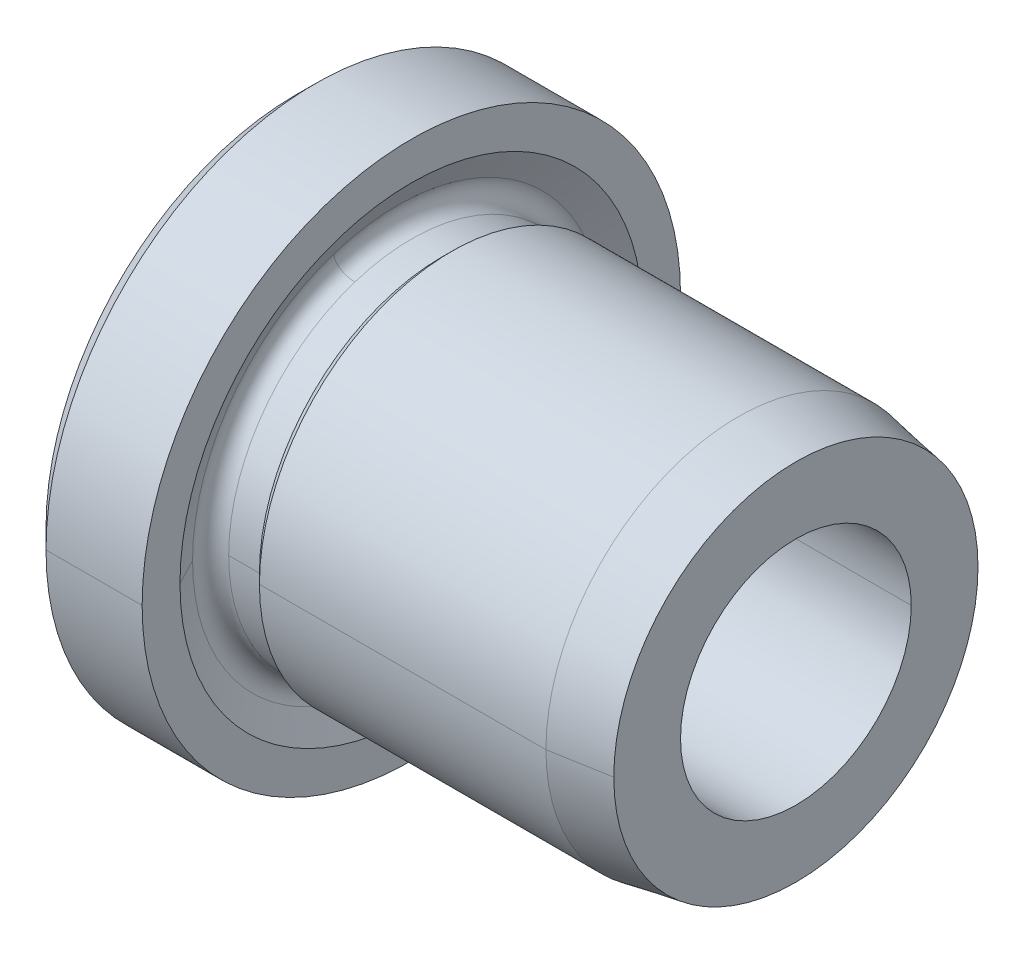
ISO-10303-21;
HEADER;
FILE_DESCRIPTION(('STEP AP214'),'2;1');
FILE_NAME('part.step','',(''),(''),'','','');
FILE_SCHEMA(('AUTOMOTIVE_DESIGN { 1 0 10303 214 1 1 1 1 }'));
ENDSEC;
DATA;
#1=APPLICATION_CONTEXT('core data for automotive mechanical design processes');
#2=APPLICATION_PROTOCOL_DEFINITION('international standard','automotive_design',2000,#1);
#3=PRODUCT_CONTEXT('',#1,'mechanical');
#4=PRODUCT('Part','Part','',(#3));
#5=PRODUCT_RELATED_PRODUCT_CATEGORY('part','',(#4));
#6=PRODUCT_DEFINITION_FORMATION('','',#4);
#7=PRODUCT_DEFINITION_CONTEXT('part definition',#1,'design');
#8=PRODUCT_DEFINITION('design','',#6,#7);
#9=PRODUCT_DEFINITION_SHAPE('','',#8);
#10=(LENGTH_UNIT() NAMED_UNIT(*) SI_UNIT(.MILLI.,.METRE.));
#11=(NAMED_UNIT(*) PLANE_ANGLE_UNIT() SI_UNIT($,.RADIAN.));
#12=(NAMED_UNIT(*) SI_UNIT($,.STERADIAN.) SOLID_ANGLE_UNIT());
#13=UNCERTAINTY_MEASURE_WITH_UNIT(LENGTH_MEASURE(1.E-05),#10,'distance_accuracy_value','');
#14=(GEOMETRIC_REPRESENTATION_CONTEXT(3) GLOBAL_UNCERTAINTY_ASSIGNED_CONTEXT((#13)) GLOBAL_UNIT_ASSIGNED_CONTEXT((#10,
#11,#12)) REPRESENTATION_CONTEXT('',''));
#15=CARTESIAN_POINT('',(0.,0.,0.));
#16=DIRECTION('',(0.,0.,1.));
#17=DIRECTION('',(1.,0.,0.));
#18=AXIS2_PLACEMENT_3D('',#15,#16,#17);
#19=CARTESIAN_POINT('',(0.,0.,0.));
#20=DIRECTION('',(1.,0.,0.));
#21=DIRECTION('',(0.,0.,-1.));
#22=AXIS2_PLACEMENT_3D('',#19,#20,#21);
#23=PLANE('',#22);
#24=CARTESIAN_POINT('',(0.,0.,0.));
#25=DIRECTION('',(1.,0.,0.));
#26=DIRECTION('',(0.,0.,-1.));
#27=AXIS2_PLACEMENT_3D('',#24,#25,#26);
#28=CIRCLE('',#27,6.5);
#29=CARTESIAN_POINT('',(0.,0.,6.5));
#30=VERTEX_POINT('',#29);
#31=CARTESIAN_POINT('',(0.,0.,-6.5));
#32=VERTEX_POINT('',#31);
#33=EDGE_CURVE('E11',#30,#32,#28,.T.);
#34=ORIENTED_EDGE('',*,*,#33,.F.);
#35=CARTESIAN_POINT('',(0.,0.,0.));
#36=DIRECTION('',(1.,0.,0.));
#37=DIRECTION('',(0.,0.,-1.));
#38=AXIS2_PLACEMENT_3D('',#35,#36,#37);
#39=CIRCLE('',#38,6.5);
#40=EDGE_CURVE('E25',#32,#30,#39,.T.);
#41=ORIENTED_EDGE('',*,*,#40,.F.);
#42=EDGE_LOOP('',(#34,#41));
#43=FACE_BOUND('',#42,.T.);
#44=CARTESIAN_POINT('',(0.,0.,0.));
#45=DIRECTION('',(1.,0.,0.));
#46=DIRECTION('',(0.,0.,-1.));
#47=AXIS2_PLACEMENT_3D('',#44,#45,#46);
#48=CIRCLE('',#47,4.);
#49=CARTESIAN_POINT('',(0.,3.80422606518069,1.23606797749981));
#50=VERTEX_POINT('',#49);
#51=CARTESIAN_POINT('',(0.,-3.80422606518069,-1.23606797749981));
#52=VERTEX_POINT('',#51);
#53=EDGE_CURVE('E433',#50,#52,#48,.T.);
#54=ORIENTED_EDGE('',*,*,#53,.T.);
#55=CARTESIAN_POINT('',(0.,-3.80422606518061,-1.23606797749979));
#56=CARTESIAN_POINT('',(0.,-3.41553987761303,-2.43066938766863));
#57=CARTESIAN_POINT('',(0.,-2.55983013383947,-3.47605013012446));
#58=CARTESIAN_POINT('',(0.,-1.30682479287781,-4.1128624749789));
#59=CARTESIAN_POINT('',(0.,1.38818666463429,-4.27239924427118));
#60=CARTESIAN_POINT('',(0.,3.47472337360838,-2.55924329720119));
#61=CARTESIAN_POINT('',(0.,4.11411708370573,-1.30755322752522));
#62=CARTESIAN_POINT('',(0.,4.19194142522466,0.0411511263469084));
#63=CARTESIAN_POINT('',(0.,3.80422606518061,1.23606797749979));
#64=B_SPLINE_CURVE_WITH_KNOTS('',5,(#55,#56,#57,#58,#59,#60,#61,#62,#63),.UNSPECIFIED.,.F.,.F.,
(6,3,6),(0.,1.5707963267949,3.14159265358979),.UNSPECIFIED.);
#65=EDGE_CURVE('E435',#52,#50,#64,.T.);
#66=ORIENTED_EDGE('',*,*,#65,.T.);
#67=EDGE_LOOP('',(#54,#66));
#68=FACE_BOUND('',#67,.T.);
#69=ADVANCED_FACE('F16',(#43,#68),#23,.F.);
#70=CARTESIAN_POINT('',(1.00000000000008,0.,0.));
#71=DIRECTION('',(1.,0.,0.));
#72=DIRECTION('',(0.,-0.309016994374947,0.951056516295154));
#73=AXIS2_PLACEMENT_3D('',#70,#71,#72);
#74=TOROIDAL_SURFACE('',#73,4.00000000000008,1.00000000000008);
#75=CARTESIAN_POINT('',(1.00000000000008,-3.80422606518069,-1.23606797749981));
#76=DIRECTION('',(0.,0.309016994374947,-0.951056516295154));
#77=DIRECTION('',(-1.,0.,0.));
#78=AXIS2_PLACEMENT_3D('',#75,#76,#77);
#79=CIRCLE('',#78,1.00000000000008);
#80=CARTESIAN_POINT('',(1.,-2.85316954888546,-0.927050983124843));
#81=VERTEX_POINT('',#80);
#82=EDGE_CURVE('E440',#52,#81,#79,.T.);
#83=ORIENTED_EDGE('',*,*,#82,.T.);
#84=CARTESIAN_POINT('',(1.,0.,0.));
#85=DIRECTION('',(1.,0.,0.));
#86=DIRECTION('',(0.,0.,-1.));
#87=AXIS2_PLACEMENT_3D('',#84,#85,#86);
#88=CIRCLE('',#87,3.);
#89=CARTESIAN_POINT('',(1.,0.,-3.));
#90=VERTEX_POINT('',#89);
#91=EDGE_CURVE('E443',#81,#90,#88,.T.);
#92=ORIENTED_EDGE('',*,*,#91,.T.);
#93=CARTESIAN_POINT('',(1.,0.,0.));
#94=DIRECTION('',(1.,0.,0.));
#95=DIRECTION('',(0.,0.,-1.));
#96=AXIS2_PLACEMENT_3D('',#93,#94,#95);
#97=CIRCLE('',#96,3.);
#98=CARTESIAN_POINT('',(1.,2.85316954888546,0.927050983124843));
#99=VERTEX_POINT('',#98);
#100=EDGE_CURVE('E446',#90,#99,#97,.T.);
#101=ORIENTED_EDGE('',*,*,#100,.T.);
#102=CARTESIAN_POINT('',(1.00000000000008,3.80422606518069,1.23606797749981));
#103=DIRECTION('',(0.,-0.309016994374947,0.951056516295154));
#104=DIRECTION('',(-1.,0.,0.));
#105=AXIS2_PLACEMENT_3D('',#102,#103,#104);
#106=CIRCLE('',#105,1.00000000000008);
#107=EDGE_CURVE('E332',#50,#99,#106,.T.);
#108=ORIENTED_EDGE('',*,*,#107,.F.);
#109=ORIENTED_EDGE('',*,*,#65,.F.);
#110=EDGE_LOOP('',(#83,#92,#101,#108,#109));
#111=FACE_BOUND('',#110,.T.);
#112=ADVANCED_FACE('F340',(#111),#74,.T.);
#113=CARTESIAN_POINT('',(1.00000000000008,0.,0.));
#114=DIRECTION('',(1.,0.,0.));
#115=DIRECTION('',(0.,0.309016994374947,-0.951056516295154));
#116=AXIS2_PLACEMENT_3D('',#113,#114,#115);
#117=TOROIDAL_SURFACE('',#116,4.00000000000008,1.00000000000008);
#118=ORIENTED_EDGE('',*,*,#82,.F.);
#119=ORIENTED_EDGE('',*,*,#53,.F.);
#120=ORIENTED_EDGE('',*,*,#107,.T.);
#121=CARTESIAN_POINT('',(1.,0.,0.));
#122=DIRECTION('',(1.,0.,0.));
#123=DIRECTION('',(0.,0.,-1.));
#124=AXIS2_PLACEMENT_3D('',#121,#122,#123);
#125=CIRCLE('',#124,3.);
#126=CARTESIAN_POINT('',(1.,0.,3.));
#127=VERTEX_POINT('',#126);
#128=EDGE_CURVE('E328',#99,#127,#125,.T.);
#129=ORIENTED_EDGE('',*,*,#128,.T.);
#130=CARTESIAN_POINT('',(1.,0.,0.));
#131=DIRECTION('',(1.,0.,0.));
#132=DIRECTION('',(0.,0.,-1.));
#133=AXIS2_PLACEMENT_3D('',#130,#131,#132);
#134=CIRCLE('',#133,3.);
#135=EDGE_CURVE('E323',#127,#81,#134,.T.);
#136=ORIENTED_EDGE('',*,*,#135,.T.);
#137=EDGE_LOOP('',(#118,#119,#120,#129,#136));
#138=FACE_BOUND('',#137,.T.);
#139=ADVANCED_FACE('F349',(#138),#117,.T.);
#140=CARTESIAN_POINT('',(13.,0.,0.));
#141=DIRECTION('',(1.,0.,0.));
#142=DIRECTION('',(0.,1.,0.));
#143=AXIS2_PLACEMENT_3D('',#140,#141,#142);
#144=CYLINDRICAL_SURFACE('',#143,3.);
#145=DIRECTION('',(1.,0.,0.));
#146=VECTOR('',#145,1.);
#147=CARTESIAN_POINT('',(1.,0.,3.));
#148=LINE('',#147,#146);
#149=CARTESIAN_POINT('',(13.,0.,3.));
#150=VERTEX_POINT('',#149);
#151=EDGE_CURVE('E319',#127,#150,#148,.T.);
#152=ORIENTED_EDGE('',*,*,#151,.T.);
#153=CARTESIAN_POINT('',(13.,0.,0.));
#154=DIRECTION('',(1.,0.,0.));
#155=DIRECTION('',(0.,0.,-1.));
#156=AXIS2_PLACEMENT_3D('',#153,#154,#155);
#157=CIRCLE('',#156,3.);
#158=CARTESIAN_POINT('',(13.,0.,-3.));
#159=VERTEX_POINT('',#158);
#160=EDGE_CURVE('E315',#150,#159,#157,.T.);
#161=ORIENTED_EDGE('',*,*,#160,.T.);
#162=DIRECTION('',(1.,0.,0.));
#163=VECTOR('',#162,1.);
#164=CARTESIAN_POINT('',(1.,0.,-3.));
#165=LINE('',#164,#163);
#166=EDGE_CURVE('E310',#90,#159,#165,.T.);
#167=ORIENTED_EDGE('',*,*,#166,.F.);
#168=ORIENTED_EDGE('',*,*,#91,.F.);
#169=ORIENTED_EDGE('',*,*,#135,.F.);
#170=EDGE_LOOP('',(#152,#161,#167,#168,#169));
#171=FACE_BOUND('',#170,.T.);
#172=ADVANCED_FACE('F353',(#171),#144,.F.);
#173=CARTESIAN_POINT('',(13.,0.,0.));
#174=DIRECTION('',(1.,0.,0.));
#175=DIRECTION('',(0.,-1.,0.));
#176=AXIS2_PLACEMENT_3D('',#173,#174,#175);
#177=CYLINDRICAL_SURFACE('',#176,3.);
#178=ORIENTED_EDGE('',*,*,#151,.F.);
#179=ORIENTED_EDGE('',*,*,#128,.F.);
#180=ORIENTED_EDGE('',*,*,#100,.F.);
#181=ORIENTED_EDGE('',*,*,#166,.T.);
#182=CARTESIAN_POINT('',(13.,0.,0.));
#183=DIRECTION('',(1.,0.,0.));
#184=DIRECTION('',(0.,0.,-1.));
#185=AXIS2_PLACEMENT_3D('',#182,#183,#184);
#186=CIRCLE('',#185,3.);
#187=EDGE_CURVE('E305',#159,#150,#186,.T.);
#188=ORIENTED_EDGE('',*,*,#187,.T.);
#189=EDGE_LOOP('',(#178,#179,#180,#181,#188));
#190=FACE_BOUND('',#189,.T.);
#191=ADVANCED_FACE('F357',(#190),#177,.F.);
#192=CARTESIAN_POINT('',(13.,4.7355095289373,0.));
#193=DIRECTION('',(-1.,0.,0.));
#194=DIRECTION('',(0.,0.,1.));
#195=AXIS2_PLACEMENT_3D('',#192,#193,#194);
#196=PLANE('',#195);
#197=ORIENTED_EDGE('',*,*,#160,.F.);
#198=ORIENTED_EDGE('',*,*,#187,.F.);
#199=EDGE_LOOP('',(#197,#198));
#200=FACE_BOUND('',#199,.T.);
#201=CARTESIAN_POINT('',(13.,0.,0.));
#202=DIRECTION('',(1.,0.,0.));
#203=DIRECTION('',(0.,0.,-1.));
#204=AXIS2_PLACEMENT_3D('',#201,#202,#203);
#205=CIRCLE('',#204,4.7355095289373);
#206=CARTESIAN_POINT('',(13.,0.,-4.7355095289373));
#207=VERTEX_POINT('',#206);
#208=CARTESIAN_POINT('',(13.,0.,4.7355095289373));
#209=VERTEX_POINT('',#208);
#210=EDGE_CURVE('E301',#207,#209,#205,.T.);
#211=ORIENTED_EDGE('',*,*,#210,.T.);
#212=CARTESIAN_POINT('',(13.,0.,0.));
#213=DIRECTION('',(1.,0.,0.));
#214=DIRECTION('',(0.,0.,-1.));
#215=AXIS2_PLACEMENT_3D('',#212,#213,#214);
#216=CIRCLE('',#215,4.7355095289373);
#217=EDGE_CURVE('E297',#209,#207,#216,.T.);
#218=ORIENTED_EDGE('',*,*,#217,.T.);
#219=EDGE_LOOP('',(#211,#218));
#220=FACE_BOUND('',#219,.T.);
#221=ADVANCED_FACE('F361',(#200,#220),#196,.F.);
#222=CARTESIAN_POINT('',(11.5,0.,0.));
#223=DIRECTION('',(-1.,0.,0.));
#224=DIRECTION('',(0.,1.,0.));
#225=AXIS2_PLACEMENT_3D('',#222,#223,#224);
#226=CONICAL_SURFACE('',#225,5.,0.174532925199435);
#227=DIRECTION('',(-0.984807753012208,0.,-0.173648177666932));
#228=VECTOR('',#227,1.);
#229=CARTESIAN_POINT('',(13.,0.,-4.7355095289373));
#230=LINE('',#229,#228);
#231=CARTESIAN_POINT('',(11.5,0.,-5.));
#232=VERTEX_POINT('',#231);
#233=EDGE_CURVE('E292',#207,#232,#230,.T.);
#234=ORIENTED_EDGE('',*,*,#233,.F.);
#235=ORIENTED_EDGE('',*,*,#217,.F.);
#236=DIRECTION('',(-0.984807753012208,0.,0.173648177666932));
#237=VECTOR('',#236,1.);
#238=CARTESIAN_POINT('',(13.,0.,4.7355095289373));
#239=LINE('',#238,#237);
#240=CARTESIAN_POINT('',(11.5,0.,5.));
#241=VERTEX_POINT('',#240);
#242=EDGE_CURVE('E288',#209,#241,#239,.T.);
#243=ORIENTED_EDGE('',*,*,#242,.T.);
#244=CARTESIAN_POINT('',(11.5,0.,0.));
#245=DIRECTION('',(1.,0.,0.));
#246=DIRECTION('',(0.,0.,-1.));
#247=AXIS2_PLACEMENT_3D('',#244,#245,#246);
#248=CIRCLE('',#247,5.);
#249=EDGE_CURVE('E284',#241,#232,#248,.T.);
#250=ORIENTED_EDGE('',*,*,#249,.T.);
#251=EDGE_LOOP('',(#234,#235,#243,#250));
#252=FACE_BOUND('',#251,.T.);
#253=ADVANCED_FACE('F365',(#252),#226,.T.);
#254=CARTESIAN_POINT('',(13.,0.,0.));
#255=DIRECTION('',(1.,0.,0.));
#256=DIRECTION('',(0.,1.,0.));
#257=AXIS2_PLACEMENT_3D('',#254,#255,#256);
#258=CYLINDRICAL_SURFACE('',#257,5.);
#259=DIRECTION('',(1.,0.,0.));
#260=VECTOR('',#259,1.);
#261=CARTESIAN_POINT('',(4.05,0.,5.));
#262=LINE('',#261,#260);
#263=CARTESIAN_POINT('',(4.05,0.,5.));
#264=VERTEX_POINT('',#263);
#265=EDGE_CURVE('E279',#264,#241,#262,.T.);
#266=ORIENTED_EDGE('',*,*,#265,.F.);
#267=CARTESIAN_POINT('',(4.05,0.,0.));
#268=DIRECTION('',(1.,0.,0.));
#269=DIRECTION('',(0.,0.,-1.));
#270=AXIS2_PLACEMENT_3D('',#267,#268,#269);
#271=CIRCLE('',#270,5.);
#272=CARTESIAN_POINT('',(4.05,0.,-5.));
#273=VERTEX_POINT('',#272);
#274=EDGE_CURVE('E275',#264,#273,#271,.T.);
#275=ORIENTED_EDGE('',*,*,#274,.T.);
#276=DIRECTION('',(1.,0.,0.));
#277=VECTOR('',#276,1.);
#278=CARTESIAN_POINT('',(4.05,0.,-5.));
#279=LINE('',#278,#277);
#280=EDGE_CURVE('E270',#273,#232,#279,.T.);
#281=ORIENTED_EDGE('',*,*,#280,.T.);
#282=ORIENTED_EDGE('',*,*,#249,.F.);
#283=EDGE_LOOP('',(#266,#275,#281,#282));
#284=FACE_BOUND('',#283,.T.);
#285=ADVANCED_FACE('F369',(#284),#258,.T.);
#286=CARTESIAN_POINT('',(13.,0.,0.));
#287=DIRECTION('',(1.,0.,0.));
#288=DIRECTION('',(0.,-1.,0.));
#289=AXIS2_PLACEMENT_3D('',#286,#287,#288);
#290=CYLINDRICAL_SURFACE('',#289,5.);
#291=ORIENTED_EDGE('',*,*,#265,.T.);
#292=CARTESIAN_POINT('',(11.5,0.,0.));
#293=DIRECTION('',(1.,0.,0.));
#294=DIRECTION('',(0.,0.,-1.));
#295=AXIS2_PLACEMENT_3D('',#292,#293,#294);
#296=CIRCLE('',#295,5.);
#297=EDGE_CURVE('E265',#232,#241,#296,.T.);
#298=ORIENTED_EDGE('',*,*,#297,.F.);
#299=ORIENTED_EDGE('',*,*,#280,.F.);
#300=CARTESIAN_POINT('',(4.05,0.,0.));
#301=DIRECTION('',(1.,0.,0.));
#302=DIRECTION('',(0.,0.,-1.));
#303=AXIS2_PLACEMENT_3D('',#300,#301,#302);
#304=CIRCLE('',#303,5.);
#305=EDGE_CURVE('E260',#273,#264,#304,.T.);
#306=ORIENTED_EDGE('',*,*,#305,.T.);
#307=EDGE_LOOP('',(#291,#298,#299,#306));
#308=FACE_BOUND('',#307,.T.);
#309=ADVANCED_FACE('F373',(#308),#290,.T.);
#310=CARTESIAN_POINT('',(3.8,0.,0.));
#311=DIRECTION('',(1.,0.,0.));
#312=DIRECTION('',(0.,-1.,0.));
#313=AXIS2_PLACEMENT_3D('',#310,#311,#312);
#314=CONICAL_SURFACE('',#313,4.75,0.785398163397448);
#315=DIRECTION('',(0.707106781186548,0.,0.707106781186548));
#316=VECTOR('',#315,1.);
#317=CARTESIAN_POINT('',(3.8,0.,4.75));
#318=LINE('',#317,#316);
#319=CARTESIAN_POINT('',(3.8,0.,4.75));
#320=VERTEX_POINT('',#319);
#321=EDGE_CURVE('E255',#320,#264,#318,.T.);
#322=ORIENTED_EDGE('',*,*,#321,.T.);
#323=ORIENTED_EDGE('',*,*,#305,.F.);
#324=DIRECTION('',(0.707106781186548,0.,-0.707106781186548));
#325=VECTOR('',#324,1.);
#326=CARTESIAN_POINT('',(3.8,0.,-4.75));
#327=LINE('',#326,#325);
#328=CARTESIAN_POINT('',(3.8,0.,-4.75));
#329=VERTEX_POINT('',#328);
#330=EDGE_CURVE('E250',#329,#273,#327,.T.);
#331=ORIENTED_EDGE('',*,*,#330,.F.);
#332=CARTESIAN_POINT('',(3.8,0.,0.));
#333=DIRECTION('',(1.,0.,0.));
#334=DIRECTION('',(0.,0.,-1.));
#335=AXIS2_PLACEMENT_3D('',#332,#333,#334);
#336=CIRCLE('',#335,4.75);
#337=EDGE_CURVE('E246',#329,#320,#336,.T.);
#338=ORIENTED_EDGE('',*,*,#337,.T.);
#339=EDGE_LOOP('',(#322,#323,#331,#338));
#340=FACE_BOUND('',#339,.T.);
#341=ADVANCED_FACE('F377',(#340),#314,.T.);
#342=CARTESIAN_POINT('',(50.,0.,0.));
#343=DIRECTION('',(1.,0.,0.));
#344=DIRECTION('',(0.,-1.,-2.38000569422679E-10));
#345=AXIS2_PLACEMENT_3D('',#342,#343,#344);
#346=CYLINDRICAL_SURFACE('',#345,4.75);
#347=DIRECTION('',(1.,0.,0.));
#348=VECTOR('',#347,1.);
#349=CARTESIAN_POINT('',(3.,0.,4.75));
#350=LINE('',#349,#348);
#351=CARTESIAN_POINT('',(3.,0.,4.75));
#352=VERTEX_POINT('',#351);
#353=EDGE_CURVE('E241',#352,#320,#350,.T.);
#354=ORIENTED_EDGE('',*,*,#353,.T.);
#355=ORIENTED_EDGE('',*,*,#337,.F.);
#356=DIRECTION('',(1.,0.,0.));
#357=VECTOR('',#356,1.);
#358=CARTESIAN_POINT('',(3.,0.,-4.75));
#359=LINE('',#358,#357);
#360=CARTESIAN_POINT('',(3.,0.,-4.75));
#361=VERTEX_POINT('',#360);
#362=EDGE_CURVE('E236',#361,#329,#359,.T.);
#363=ORIENTED_EDGE('',*,*,#362,.F.);
#364=CARTESIAN_POINT('',(3.,0.,0.));
#365=DIRECTION('',(1.,0.,0.));
#366=DIRECTION('',(0.,0.,-1.));
#367=AXIS2_PLACEMENT_3D('',#364,#365,#366);
#368=CIRCLE('',#367,4.75);
#369=CARTESIAN_POINT('',(3.,4.51751845240199,1.467830723281));
#370=VERTEX_POINT('',#369);
#371=EDGE_CURVE('E232',#361,#370,#368,.T.);
#372=ORIENTED_EDGE('',*,*,#371,.T.);
#373=CARTESIAN_POINT('',(3.,0.,0.));
#374=DIRECTION('',(1.,0.,0.));
#375=DIRECTION('',(0.,0.,-1.));
#376=AXIS2_PLACEMENT_3D('',#373,#374,#375);
#377=CIRCLE('',#376,4.75);
#378=EDGE_CURVE('E228',#370,#352,#377,.T.);
#379=ORIENTED_EDGE('',*,*,#378,.T.);
#380=EDGE_LOOP('',(#354,#355,#363,#372,#379));
#381=FACE_BOUND('',#380,.T.);
#382=ADVANCED_FACE('F381',(#381),#346,.T.);
#383=CARTESIAN_POINT('',(3.,0.,0.));
#384=DIRECTION('',(1.,0.,0.));
#385=DIRECTION('',(0.,0.309016994374947,-0.951056516295154));
#386=AXIS2_PLACEMENT_3D('',#383,#384,#385);
#387=TOROIDAL_SURFACE('',#386,5.15,0.399999999999989);
#388=CARTESIAN_POINT('',(3.,-4.89794105892004,-1.59143752103098));
#389=DIRECTION('',(0.,0.309016994374947,-0.951056516295154));
#390=DIRECTION('',(-0.887010833178241,-0.439149027507394,-0.142688168618679));
#391=AXIS2_PLACEMENT_3D('',#388,#389,#390);
#392=CIRCLE('',#391,0.399999999999989);
#393=CARTESIAN_POINT('',(2.64519566672871,-5.07360066992299,-1.64851278847845));
#394=VERTEX_POINT('',#393);
#395=CARTESIAN_POINT('',(3.,-4.51751845240199,-1.467830723281));
#396=VERTEX_POINT('',#395);
#397=EDGE_CURVE('E224',#394,#396,#392,.T.);
#398=ORIENTED_EDGE('',*,*,#397,.T.);
#399=CARTESIAN_POINT('',(3.,0.,0.));
#400=DIRECTION('',(1.,0.,0.));
#401=DIRECTION('',(0.,0.,-1.));
#402=AXIS2_PLACEMENT_3D('',#399,#400,#401);
#403=CIRCLE('',#402,4.75);
#404=EDGE_CURVE('E219',#352,#396,#403,.T.);
#405=ORIENTED_EDGE('',*,*,#404,.F.);
#406=ORIENTED_EDGE('',*,*,#378,.F.);
#407=CARTESIAN_POINT('',(3.,4.89794105892004,1.59143752103098));
#408=DIRECTION('',(0.,-0.309016994374947,0.951056516295154));
#409=DIRECTION('',(-0.88701083317824,0.439149027507396,0.142688168618679));
#410=AXIS2_PLACEMENT_3D('',#407,#408,#409);
#411=CIRCLE('',#410,0.399999999999989);
#412=CARTESIAN_POINT('',(2.64519566672871,5.073600669923,1.64851278847845));
#413=VERTEX_POINT('',#412);
#414=EDGE_CURVE('E214',#413,#370,#411,.T.);
#415=ORIENTED_EDGE('',*,*,#414,.F.);
#416=CARTESIAN_POINT('',(2.64519566672871,0.,0.));
#417=DIRECTION('',(1.,0.,0.));
#418=DIRECTION('',(0.,0.,-1.));
#419=AXIS2_PLACEMENT_3D('',#416,#417,#418);
#420=CIRCLE('',#419,5.334699445294);
#421=CARTESIAN_POINT('',(2.6451956667287,0.,5.334699445294));
#422=VERTEX_POINT('',#421);
#423=EDGE_CURVE('E210',#413,#422,#420,.T.);
#424=ORIENTED_EDGE('',*,*,#423,.T.);
#425=CARTESIAN_POINT('',(2.64519566672871,0.,0.));
#426=DIRECTION('',(1.,0.,0.));
#427=DIRECTION('',(0.,0.,-1.));
#428=AXIS2_PLACEMENT_3D('',#425,#426,#427);
#429=CIRCLE('',#428,5.334699445294);
#430=EDGE_CURVE('E206',#422,#394,#429,.T.);
#431=ORIENTED_EDGE('',*,*,#430,.T.);
#432=EDGE_LOOP('',(#398,#405,#406,#415,#424,#431));
#433=FACE_BOUND('',#432,.T.);
#434=ADVANCED_FACE('F385',(#433),#387,.F.);
#435=CARTESIAN_POINT('',(3.1216709768604,0.,0.));
#436=DIRECTION('',(1.,0.,0.));
#437=DIRECTION('',(0.,1.,0.));
#438=AXIS2_PLACEMENT_3D('',#435,#436,#437);
#439=CONICAL_SURFACE('',#438,6.25,1.09083078249644);
#440=DIRECTION('',(0.461748613235046,0.,0.887010833178215));
#441=VECTOR('',#440,1.);
#442=CARTESIAN_POINT('',(2.6451956667287,0.,5.334699445294));
#443=LINE('',#442,#441);
#444=CARTESIAN_POINT('',(3.,0.,6.01627222808006));
#445=VERTEX_POINT('',#444);
#446=EDGE_CURVE('E202',#422,#445,#443,.T.);
#447=ORIENTED_EDGE('',*,*,#446,.T.);
#448=CARTESIAN_POINT('',(3.,0.,0.));
#449=DIRECTION('',(-1.,0.,0.));
#450=DIRECTION('',(0.,0.,1.));
#451=AXIS2_PLACEMENT_3D('',#448,#449,#450);
#452=CIRCLE('',#451,6.01627222808006);
#453=CARTESIAN_POINT('',(3.,0.,-6.01627222808006));
#454=VERTEX_POINT('',#453);
#455=EDGE_CURVE('E197',#454,#445,#452,.T.);
#456=ORIENTED_EDGE('',*,*,#455,.F.);
#457=DIRECTION('',(0.461748613235046,0.,-0.887010833178215));
#458=VECTOR('',#457,1.);
#459=CARTESIAN_POINT('',(2.6451956667287,0.,-5.334699445294));
#460=LINE('',#459,#458);
#461=CARTESIAN_POINT('',(2.64519566672871,0.,-5.334699445294));
#462=VERTEX_POINT('',#461);
#463=EDGE_CURVE('E192',#462,#454,#460,.T.);
#464=ORIENTED_EDGE('',*,*,#463,.F.);
#465=CARTESIAN_POINT('',(2.64519566672871,0.,0.));
#466=DIRECTION('',(1.,0.,0.));
#467=DIRECTION('',(0.,0.,-1.));
#468=AXIS2_PLACEMENT_3D('',#465,#466,#467);
#469=CIRCLE('',#468,5.334699445294);
#470=EDGE_CURVE('E187',#394,#462,#469,.T.);
#471=ORIENTED_EDGE('',*,*,#470,.F.);
#472=ORIENTED_EDGE('',*,*,#430,.F.);
#473=EDGE_LOOP('',(#447,#456,#464,#471,#472));
#474=FACE_BOUND('',#473,.T.);
#475=ADVANCED_FACE('F389',(#474),#439,.F.);
#476=CARTESIAN_POINT('',(3.,0.,0.));
#477=DIRECTION('',(1.,0.,0.));
#478=DIRECTION('',(0.,-0.309016994374947,0.951056516295154));
#479=AXIS2_PLACEMENT_3D('',#476,#477,#478);
#480=TOROIDAL_SURFACE('',#479,5.15,0.399999999999989);
#481=ORIENTED_EDGE('',*,*,#397,.F.);
#482=ORIENTED_EDGE('',*,*,#470,.T.);
#483=CARTESIAN_POINT('',(2.64519566672871,0.,0.));
#484=DIRECTION('',(1.,0.,0.));
#485=DIRECTION('',(0.,0.,-1.));
#486=AXIS2_PLACEMENT_3D('',#483,#484,#485);
#487=CIRCLE('',#486,5.334699445294);
#488=EDGE_CURVE('E182',#462,#413,#487,.T.);
#489=ORIENTED_EDGE('',*,*,#488,.T.);
#490=ORIENTED_EDGE('',*,*,#414,.T.);
#491=ORIENTED_EDGE('',*,*,#371,.F.);
#492=CARTESIAN_POINT('',(3.,0.,0.));
#493=DIRECTION('',(1.,0.,0.));
#494=DIRECTION('',(0.,0.,-1.));
#495=AXIS2_PLACEMENT_3D('',#492,#493,#494);
#496=CIRCLE('',#495,4.75);
#497=EDGE_CURVE('E177',#396,#361,#496,.T.);
#498=ORIENTED_EDGE('',*,*,#497,.F.);
#499=EDGE_LOOP('',(#481,#482,#489,#490,#491,#498));
#500=FACE_BOUND('',#499,.T.);
#501=ADVANCED_FACE('F393',(#500),#480,.F.);
#502=CARTESIAN_POINT('',(50.,0.,0.));
#503=DIRECTION('',(1.,0.,0.));
#504=DIRECTION('',(0.,1.,0.));
#505=AXIS2_PLACEMENT_3D('',#502,#503,#504);
#506=CYLINDRICAL_SURFACE('',#505,4.75);
#507=ORIENTED_EDGE('',*,*,#353,.F.);
#508=ORIENTED_EDGE('',*,*,#404,.T.);
#509=ORIENTED_EDGE('',*,*,#497,.T.);
#510=ORIENTED_EDGE('',*,*,#362,.T.);
#511=CARTESIAN_POINT('',(3.8,0.,0.));
#512=DIRECTION('',(1.,0.,0.));
#513=DIRECTION('',(0.,0.,-1.));
#514=AXIS2_PLACEMENT_3D('',#511,#512,#513);
#515=CIRCLE('',#514,4.75);
#516=EDGE_CURVE('E172',#320,#329,#515,.T.);
#517=ORIENTED_EDGE('',*,*,#516,.F.);
#518=EDGE_LOOP('',(#507,#508,#509,#510,#517));
#519=FACE_BOUND('',#518,.T.);
#520=ADVANCED_FACE('F397',(#519),#506,.T.);
#521=CARTESIAN_POINT('',(3.8,0.,0.));
#522=DIRECTION('',(1.,0.,0.));
#523=DIRECTION('',(0.,1.,0.));
#524=AXIS2_PLACEMENT_3D('',#521,#522,#523);
#525=CONICAL_SURFACE('',#524,4.75,0.785398163397448);
#526=ORIENTED_EDGE('',*,*,#321,.F.);
#527=ORIENTED_EDGE('',*,*,#516,.T.);
#528=ORIENTED_EDGE('',*,*,#330,.T.);
#529=ORIENTED_EDGE('',*,*,#274,.F.);
#530=EDGE_LOOP('',(#526,#527,#528,#529));
#531=FACE_BOUND('',#530,.T.);
#532=ADVANCED_FACE('F401',(#531),#525,.T.);
#533=CARTESIAN_POINT('',(3.1216709768604,0.,0.));
#534=DIRECTION('',(1.,0.,0.));
#535=DIRECTION('',(0.,-1.,0.));
#536=AXIS2_PLACEMENT_3D('',#533,#534,#535);
#537=CONICAL_SURFACE('',#536,6.25,1.09083078249644);
#538=ORIENTED_EDGE('',*,*,#446,.F.);
#539=ORIENTED_EDGE('',*,*,#423,.F.);
#540=ORIENTED_EDGE('',*,*,#488,.F.);
#541=ORIENTED_EDGE('',*,*,#463,.T.);
#542=CARTESIAN_POINT('',(3.,0.,0.));
#543=DIRECTION('',(-1.,0.,0.));
#544=DIRECTION('',(0.,0.,1.));
#545=AXIS2_PLACEMENT_3D('',#542,#543,#544);
#546=CIRCLE('',#545,6.01627222808006);
#547=EDGE_CURVE('E167',#445,#454,#546,.T.);
#548=ORIENTED_EDGE('',*,*,#547,.F.);
#549=EDGE_LOOP('',(#538,#539,#540,#541,#548));
#550=FACE_BOUND('',#549,.T.);
#551=ADVANCED_FACE('F405',(#550),#537,.F.);
#552=CARTESIAN_POINT('',(3.,7.,0.));
#553=DIRECTION('',(-1.,0.,0.));
#554=DIRECTION('',(0.,0.,1.));
#555=AXIS2_PLACEMENT_3D('',#552,#553,#554);
#556=PLANE('',#555);
#557=ORIENTED_EDGE('',*,*,#547,.T.);
#558=ORIENTED_EDGE('',*,*,#455,.T.);
#559=EDGE_LOOP('',(#557,#558));
#560=FACE_BOUND('',#559,.T.);
#561=CARTESIAN_POINT('',(3.,0.,0.));
#562=DIRECTION('',(1.,0.,0.));
#563=DIRECTION('',(0.,0.,-1.));
#564=AXIS2_PLACEMENT_3D('',#561,#562,#563);
#565=CIRCLE('',#564,7.);
#566=CARTESIAN_POINT('',(3.,0.,-7.));
#567=VERTEX_POINT('',#566);
#568=CARTESIAN_POINT('',(3.,0.,7.));
#569=VERTEX_POINT('',#568);
#570=EDGE_CURVE('E150',#567,#569,#565,.T.);
#571=ORIENTED_EDGE('',*,*,#570,.T.);
#572=CARTESIAN_POINT('',(3.,0.,0.));
#573=DIRECTION('',(1.,0.,0.));
#574=DIRECTION('',(0.,0.,-1.));
#575=AXIS2_PLACEMENT_3D('',#572,#573,#574);
#576=CIRCLE('',#575,7.);
#577=EDGE_CURVE('E160',#569,#567,#576,.T.);
#578=ORIENTED_EDGE('',*,*,#577,.T.);
#579=EDGE_LOOP('',(#571,#578));
#580=FACE_BOUND('',#579,.T.);
#581=ADVANCED_FACE('F409',(#560,#580),#556,.F.);
#582=CARTESIAN_POINT('',(13.,0.,0.));
#583=DIRECTION('',(1.,0.,0.));
#584=DIRECTION('',(0.,1.,0.));
#585=AXIS2_PLACEMENT_3D('',#582,#583,#584);
#586=CYLINDRICAL_SURFACE('',#585,7.);
#587=DIRECTION('',(1.,0.,0.));
#588=VECTOR('',#587,1.);
#589=CARTESIAN_POINT('',(0.5,0.,7.));
#590=LINE('',#589,#588);
#591=CARTESIAN_POINT('',(0.500000000000002,0.,7.));
#592=VERTEX_POINT('',#591);
#593=EDGE_CURVE('E133',#592,#569,#590,.T.);
#594=ORIENTED_EDGE('',*,*,#593,.F.);
#595=CARTESIAN_POINT('',(0.5,0.,0.));
#596=DIRECTION('',(1.,0.,0.));
#597=DIRECTION('',(0.,0.,-1.));
#598=AXIS2_PLACEMENT_3D('',#595,#596,#597);
#599=CIRCLE('',#598,7.);
#600=CARTESIAN_POINT('',(0.5,0.,-7.));
#601=VERTEX_POINT('',#600);
#602=EDGE_CURVE('E126',#592,#601,#599,.T.);
#603=ORIENTED_EDGE('',*,*,#602,.T.);
#604=DIRECTION('',(1.,0.,0.));
#605=VECTOR('',#604,1.);
#606=CARTESIAN_POINT('',(0.5,0.,-7.));
#607=LINE('',#606,#605);
#608=EDGE_CURVE('E131',#601,#567,#607,.T.);
#609=ORIENTED_EDGE('',*,*,#608,.T.);
#610=ORIENTED_EDGE('',*,*,#577,.F.);
#611=EDGE_LOOP('',(#594,#603,#609,#610));
#612=FACE_BOUND('',#611,.T.);
#613=ADVANCED_FACE('F128',(#612),#586,.T.);
#614=CARTESIAN_POINT('',(13.,0.,0.));
#615=DIRECTION('',(1.,0.,0.));
#616=DIRECTION('',(0.,-1.,0.));
#617=AXIS2_PLACEMENT_3D('',#614,#615,#616);
#618=CYLINDRICAL_SURFACE('',#617,7.);
#619=ORIENTED_EDGE('',*,*,#593,.T.);
#620=ORIENTED_EDGE('',*,*,#570,.F.);
#621=ORIENTED_EDGE('',*,*,#608,.F.);
#622=CARTESIAN_POINT('',(0.5,0.,0.));
#623=DIRECTION('',(1.,0.,0.));
#624=DIRECTION('',(0.,0.,-1.));
#625=AXIS2_PLACEMENT_3D('',#622,#623,#624);
#626=CIRCLE('',#625,7.);
#627=EDGE_CURVE('E144',#601,#592,#626,.T.);
#628=ORIENTED_EDGE('',*,*,#627,.T.);
#629=EDGE_LOOP('',(#619,#620,#621,#628));
#630=FACE_BOUND('',#629,.T.);
#631=ADVANCED_FACE('F149',(#630),#618,.T.);
#632=CARTESIAN_POINT('',(0.,0.,0.));
#633=DIRECTION('',(1.,0.,0.));
#634=DIRECTION('',(0.,-1.,0.));
#635=AXIS2_PLACEMENT_3D('',#632,#633,#634);
#636=CONICAL_SURFACE('',#635,6.5,0.785398163397448);
#637=DIRECTION('',(0.707106781186548,0.,0.707106781186547));
#638=VECTOR('',#637,1.);
#639=CARTESIAN_POINT('',(0.,0.,6.5));
#640=LINE('',#639,#638);
#641=EDGE_CURVE('E141',#30,#592,#640,.T.);
#642=ORIENTED_EDGE('',*,*,#641,.T.);
#643=ORIENTED_EDGE('',*,*,#627,.F.);
#644=DIRECTION('',(0.707106781186548,0.,-0.707106781186547));
#645=VECTOR('',#644,1.);
#646=CARTESIAN_POINT('',(0.,0.,-6.5));
#647=LINE('',#646,#645);
#648=EDGE_CURVE('E137',#32,#601,#647,.T.);
#649=ORIENTED_EDGE('',*,*,#648,.F.);
#650=ORIENTED_EDGE('',*,*,#40,.T.);
#651=EDGE_LOOP('',(#642,#643,#649,#650));
#652=FACE_BOUND('',#651,.T.);
#653=ADVANCED_FACE('F145',(#652),#636,.T.);
#654=CARTESIAN_POINT('',(0.,0.,0.));
#655=DIRECTION('',(1.,0.,0.));
#656=DIRECTION('',(0.,1.,0.));
#657=AXIS2_PLACEMENT_3D('',#654,#655,#656);
#658=CONICAL_SURFACE('',#657,6.5,0.785398163397448);
#659=ORIENTED_EDGE('',*,*,#641,.F.);
#660=ORIENTED_EDGE('',*,*,#33,.T.);
#661=ORIENTED_EDGE('',*,*,#648,.T.);
#662=ORIENTED_EDGE('',*,*,#602,.F.);
#663=EDGE_LOOP('',(#659,#660,#661,#662));
#664=FACE_BOUND('',#663,.T.);
#665=ADVANCED_FACE('F139',(#664),#658,.T.);
#666=CARTESIAN_POINT('',(11.5,0.,0.));
#667=DIRECTION('',(-1.,0.,0.));
#668=DIRECTION('',(0.,-1.,0.));
#669=AXIS2_PLACEMENT_3D('',#666,#667,#668);
#670=CONICAL_SURFACE('',#669,5.,0.174532925199435);
#671=ORIENTED_EDGE('',*,*,#233,.T.);
#672=ORIENTED_EDGE('',*,*,#297,.T.);
#673=ORIENTED_EDGE('',*,*,#242,.F.);
#674=ORIENTED_EDGE('',*,*,#210,.F.);
#675=EDGE_LOOP('',(#671,#672,#673,#674));
#676=FACE_BOUND('',#675,.T.);
#677=ADVANCED_FACE('F422',(#676),#670,.T.);
#678=CLOSED_SHELL('',(#69,#112,#139,#172,#191,#221,#253,#285,#309,#341,#382,#434,#475,#501,#520,
#532,#551,#581,#613,#631,#653,#665,#677));
#679=MANIFOLD_SOLID_BREP('B1',#678);
#680=ADVANCED_BREP_SHAPE_REPRESENTATION('',(#18,#679),#14);
#681=SHAPE_DEFINITION_REPRESENTATION(#9,#680);
ENDSEC;
END-ISO-10303-21;
